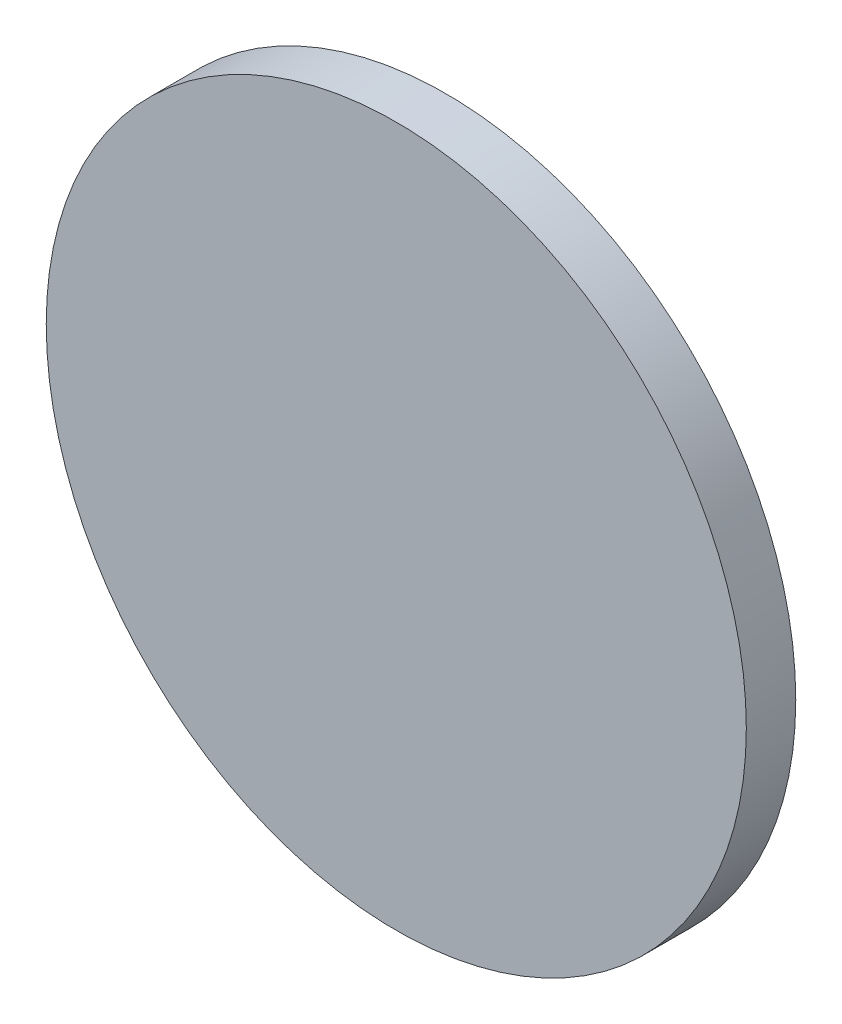
ISO-10303-21;
HEADER;
FILE_DESCRIPTION(('STEP AP214'),'2;1');
FILE_NAME('part.step','',(''),(''),'','','');
FILE_SCHEMA(('AUTOMOTIVE_DESIGN { 1 0 10303 214 1 1 1 1 }'));
ENDSEC;
DATA;
#1=APPLICATION_CONTEXT('core data for automotive mechanical design processes');
#2=APPLICATION_PROTOCOL_DEFINITION('international standard','automotive_design',2000,#1);
#3=PRODUCT_CONTEXT('',#1,'mechanical');
#4=PRODUCT('Part','Part','',(#3));
#5=PRODUCT_RELATED_PRODUCT_CATEGORY('part','',(#4));
#6=PRODUCT_DEFINITION_FORMATION('','',#4);
#7=PRODUCT_DEFINITION_CONTEXT('part definition',#1,'design');
#8=PRODUCT_DEFINITION('design','',#6,#7);
#9=PRODUCT_DEFINITION_SHAPE('','',#8);
#10=(LENGTH_UNIT() NAMED_UNIT(*) SI_UNIT(.MILLI.,.METRE.));
#11=(NAMED_UNIT(*) PLANE_ANGLE_UNIT() SI_UNIT($,.RADIAN.));
#12=(NAMED_UNIT(*) SI_UNIT($,.STERADIAN.) SOLID_ANGLE_UNIT());
#13=UNCERTAINTY_MEASURE_WITH_UNIT(LENGTH_MEASURE(1.E-05),#10,'distance_accuracy_value','');
#14=(GEOMETRIC_REPRESENTATION_CONTEXT(3) GLOBAL_UNCERTAINTY_ASSIGNED_CONTEXT((#13)) GLOBAL_UNIT_ASSIGNED_CONTEXT((#10,
#11,#12)) REPRESENTATION_CONTEXT('',''));
#15=CARTESIAN_POINT('',(0.,0.,0.));
#16=DIRECTION('',(0.,0.,1.));
#17=DIRECTION('',(1.,0.,0.));
#18=AXIS2_PLACEMENT_3D('',#15,#16,#17);
#19=CARTESIAN_POINT('',(0.,0.,6.35));
#20=DIRECTION('',(0.,0.,-1.));
#21=DIRECTION('',(-1.,0.,0.));
#22=AXIS2_PLACEMENT_3D('',#19,#20,#21);
#23=CYLINDRICAL_SURFACE('',#22,44.958);
#24=CARTESIAN_POINT('',(0.,0.,6.35));
#25=DIRECTION('',(0.,0.,1.));
#26=DIRECTION('',(1.,0.,0.));
#27=AXIS2_PLACEMENT_3D('',#24,#25,#26);
#28=CIRCLE('',#27,44.958);
#29=CARTESIAN_POINT('',(44.958,0.,6.35));
#30=VERTEX_POINT('',#29);
#31=EDGE_CURVE('E10',#30,#30,#28,.T.);
#32=ORIENTED_EDGE('',*,*,#31,.F.);
#33=EDGE_LOOP('',(#32));
#34=FACE_BOUND('',#33,.T.);
#35=CARTESIAN_POINT('',(0.,0.,0.));
#36=DIRECTION('',(0.,0.,1.));
#37=DIRECTION('',(1.,0.,0.));
#38=AXIS2_PLACEMENT_3D('',#35,#36,#37);
#39=CIRCLE('',#38,44.958);
#40=CARTESIAN_POINT('',(44.958,0.,0.));
#41=VERTEX_POINT('',#40);
#42=EDGE_CURVE('E33',#41,#41,#39,.T.);
#43=ORIENTED_EDGE('',*,*,#42,.T.);
#44=EDGE_LOOP('',(#43));
#45=FACE_BOUND('',#44,.T.);
#46=ADVANCED_FACE('F30',(#34,#45),#23,.T.);
#47=CARTESIAN_POINT('',(0.,0.,6.35));
#48=DIRECTION('',(0.,0.,1.));
#49=DIRECTION('',(1.,0.,0.));
#50=AXIS2_PLACEMENT_3D('',#47,#48,#49);
#51=PLANE('',#50);
#52=ORIENTED_EDGE('',*,*,#31,.T.);
#53=EDGE_LOOP('',(#52));
#54=FACE_BOUND('',#53,.T.);
#55=ADVANCED_FACE('F45',(#54),#51,.T.);
#56=CARTESIAN_POINT('',(0.,0.,0.));
#57=DIRECTION('',(0.,0.,1.));
#58=DIRECTION('',(1.,0.,0.));
#59=AXIS2_PLACEMENT_3D('',#56,#57,#58);
#60=PLANE('',#59);
#61=ORIENTED_EDGE('',*,*,#42,.F.);
#62=EDGE_LOOP('',(#61));
#63=FACE_BOUND('',#62,.T.);
#64=ADVANCED_FACE('F43',(#63),#60,.F.);
#65=CLOSED_SHELL('',(#46,#55,#64));
#66=MANIFOLD_SOLID_BREP('B2',#65);
#67=ADVANCED_BREP_SHAPE_REPRESENTATION('',(#18,#66),#14);
#68=SHAPE_DEFINITION_REPRESENTATION(#9,#67);
ENDSEC;
END-ISO-10303-21;
